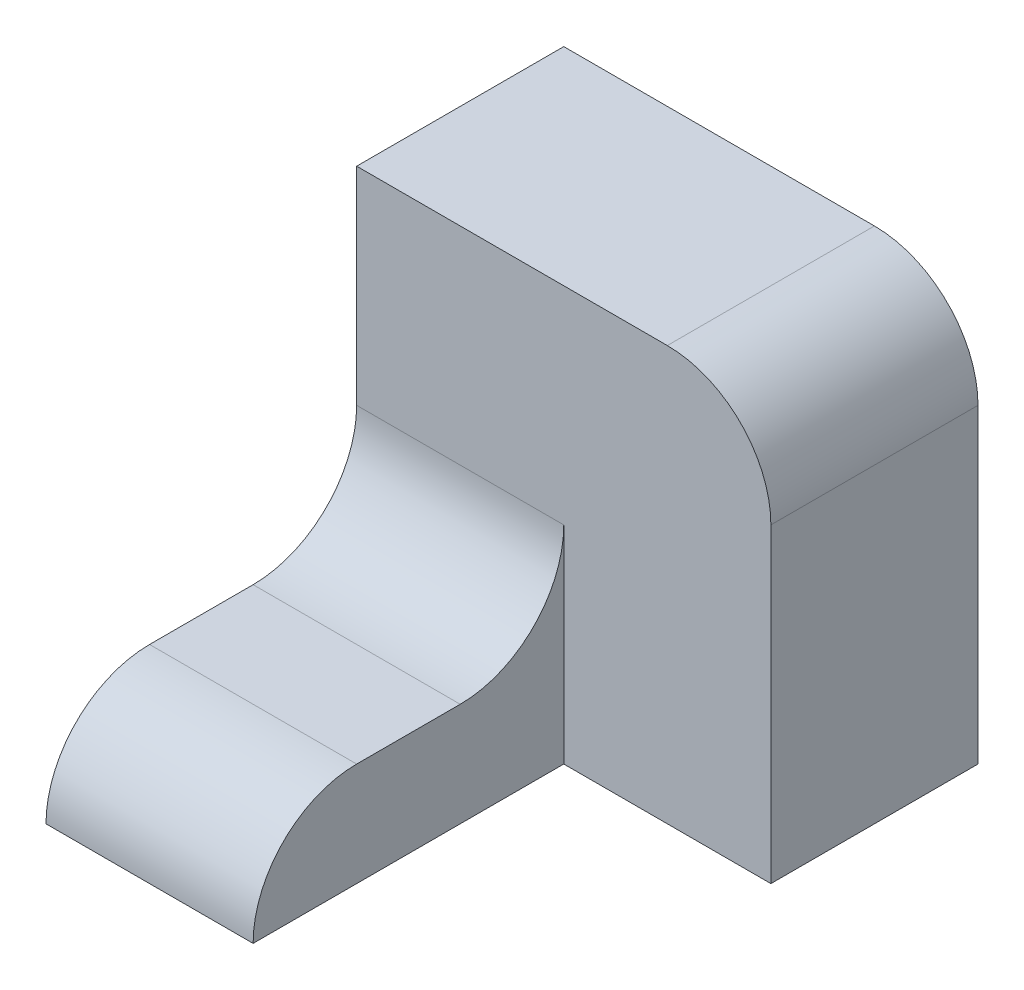
ISO-10303-21;
HEADER;
FILE_DESCRIPTION(('STEP AP214'),'2;1');
FILE_NAME('part.step','',(''),(''),'','','');
FILE_SCHEMA(('AUTOMOTIVE_DESIGN { 1 0 10303 214 1 1 1 1 }'));
ENDSEC;
DATA;
#1=APPLICATION_CONTEXT('core data for automotive mechanical design processes');
#2=APPLICATION_PROTOCOL_DEFINITION('international standard','automotive_design',2000,#1);
#3=PRODUCT_CONTEXT('',#1,'mechanical');
#4=PRODUCT('Part','Part','',(#3));
#5=PRODUCT_RELATED_PRODUCT_CATEGORY('part','',(#4));
#6=PRODUCT_DEFINITION_FORMATION('','',#4);
#7=PRODUCT_DEFINITION_CONTEXT('part definition',#1,'design');
#8=PRODUCT_DEFINITION('design','',#6,#7);
#9=PRODUCT_DEFINITION_SHAPE('','',#8);
#10=(LENGTH_UNIT() NAMED_UNIT(*) SI_UNIT(.MILLI.,.METRE.));
#11=(NAMED_UNIT(*) PLANE_ANGLE_UNIT() SI_UNIT($,.RADIAN.));
#12=(NAMED_UNIT(*) SI_UNIT($,.STERADIAN.) SOLID_ANGLE_UNIT());
#13=UNCERTAINTY_MEASURE_WITH_UNIT(LENGTH_MEASURE(1.E-05),#10,'distance_accuracy_value','');
#14=(GEOMETRIC_REPRESENTATION_CONTEXT(3) GLOBAL_UNCERTAINTY_ASSIGNED_CONTEXT((#13)) GLOBAL_UNIT_ASSIGNED_CONTEXT((#10,
#11,#12)) REPRESENTATION_CONTEXT('',''));
#15=CARTESIAN_POINT('',(0.,0.,0.));
#16=DIRECTION('',(0.,0.,1.));
#17=DIRECTION('',(1.,0.,0.));
#18=AXIS2_PLACEMENT_3D('',#15,#16,#17);
#19=CARTESIAN_POINT('',(-10.,0.,30.));
#20=DIRECTION('',(0.,-1.,0.));
#21=DIRECTION('',(1.,0.,0.));
#22=AXIS2_PLACEMENT_3D('',#19,#20,#21);
#23=PLANE('',#22);
#24=DIRECTION('',(0.,0.,-1.));
#25=VECTOR('',#24,1.);
#26=CARTESIAN_POINT('',(-10.,0.,30.));
#27=LINE('',#26,#25);
#28=CARTESIAN_POINT('',(-10.,0.,20.));
#29=VERTEX_POINT('',#28);
#30=CARTESIAN_POINT('',(-10.,0.,10.));
#31=VERTEX_POINT('',#30);
#32=EDGE_CURVE('E144',#29,#31,#27,.T.);
#33=ORIENTED_EDGE('',*,*,#32,.T.);
#34=DIRECTION('',(-1.,0.,0.));
#35=VECTOR('',#34,1.);
#36=CARTESIAN_POINT('',(-10.,0.,10.));
#37=LINE('',#36,#35);
#38=CARTESIAN_POINT('',(-30.,0.,10.));
#39=VERTEX_POINT('',#38);
#40=EDGE_CURVE('E158',#31,#39,#37,.T.);
#41=ORIENTED_EDGE('',*,*,#40,.T.);
#42=DIRECTION('',(0.,0.,-1.));
#43=VECTOR('',#42,1.);
#44=CARTESIAN_POINT('',(-30.,0.,30.));
#45=LINE('',#44,#43);
#46=CARTESIAN_POINT('',(-30.,0.,20.));
#47=VERTEX_POINT('',#46);
#48=EDGE_CURVE('E153',#47,#39,#45,.T.);
#49=ORIENTED_EDGE('',*,*,#48,.F.);
#50=DIRECTION('',(-1.,0.,0.));
#51=VECTOR('',#50,1.);
#52=CARTESIAN_POINT('',(-10.,0.,20.));
#53=LINE('',#52,#51);
#54=EDGE_CURVE('E156',#47,#29,#53,.F.);
#55=ORIENTED_EDGE('',*,*,#54,.T.);
#56=EDGE_LOOP('',(#33,#41,#49,#55));
#57=FACE_BOUND('',#56,.T.);
#58=ADVANCED_FACE('F35',(#57),#23,.F.);
#59=CARTESIAN_POINT('',(-30.,0.,30.));
#60=DIRECTION('',(1.,0.,0.));
#61=DIRECTION('',(0.,0.,-1.));
#62=AXIS2_PLACEMENT_3D('',#59,#60,#61);
#63=PLANE('',#62);
#64=DIRECTION('',(0.,0.,-1.));
#65=VECTOR('',#64,1.);
#66=CARTESIAN_POINT('',(-30.,-10.,30.));
#67=LINE('',#66,#65);
#68=CARTESIAN_POINT('',(-30.,-10.,30.));
#69=VERTEX_POINT('',#68);
#70=CARTESIAN_POINT('',(-30.,-10.,-20.));
#71=VERTEX_POINT('',#70);
#72=EDGE_CURVE('E151',#69,#71,#67,.T.);
#73=ORIENTED_EDGE('',*,*,#72,.F.);
#74=CARTESIAN_POINT('',(-30.,-10.,20.));
#75=DIRECTION('',(1.,0.,0.));
#76=DIRECTION('',(0.,0.,-1.));
#77=AXIS2_PLACEMENT_3D('',#74,#75,#76);
#78=CIRCLE('',#77,10.);
#79=EDGE_CURVE('E171',#69,#47,#78,.F.);
#80=ORIENTED_EDGE('',*,*,#79,.T.);
#81=ORIENTED_EDGE('',*,*,#48,.T.);
#82=CARTESIAN_POINT('',(-30.,10.,10.));
#83=DIRECTION('',(1.,0.,0.));
#84=DIRECTION('',(0.,0.,-1.));
#85=AXIS2_PLACEMENT_3D('',#82,#83,#84);
#86=CIRCLE('',#85,10.);
#87=CARTESIAN_POINT('',(-30.,10.,0.));
#88=VERTEX_POINT('',#87);
#89=EDGE_CURVE('E43',#39,#88,#86,.T.);
#90=ORIENTED_EDGE('',*,*,#89,.T.);
#91=DIRECTION('',(0.,-1.,0.));
#92=VECTOR('',#91,1.);
#93=CARTESIAN_POINT('',(-30.,30.,0.));
#94=LINE('',#93,#92);
#95=CARTESIAN_POINT('',(-30.,30.,0.));
#96=VERTEX_POINT('',#95);
#97=EDGE_CURVE('E119',#96,#88,#94,.T.);
#98=ORIENTED_EDGE('',*,*,#97,.F.);
#99=DIRECTION('',(0.,0.,1.));
#100=VECTOR('',#99,1.);
#101=CARTESIAN_POINT('',(-30.,30.,-20.));
#102=LINE('',#101,#100);
#103=CARTESIAN_POINT('',(-30.,30.,-20.));
#104=VERTEX_POINT('',#103);
#105=EDGE_CURVE('E108',#104,#96,#102,.T.);
#106=ORIENTED_EDGE('',*,*,#105,.F.);
#107=DIRECTION('',(0.,-1.,0.));
#108=VECTOR('',#107,1.);
#109=CARTESIAN_POINT('',(-30.,30.,-20.));
#110=LINE('',#109,#108);
#111=EDGE_CURVE('E111',#104,#71,#110,.T.);
#112=ORIENTED_EDGE('',*,*,#111,.T.);
#113=EDGE_LOOP('',(#73,#80,#81,#90,#98,#106,#112));
#114=FACE_BOUND('',#113,.T.);
#115=ADVANCED_FACE('F117',(#114),#63,.F.);
#116=CARTESIAN_POINT('',(-30.,-10.,30.));
#117=DIRECTION('',(0.,1.,0.));
#118=DIRECTION('',(0.,0.,1.));
#119=AXIS2_PLACEMENT_3D('',#116,#117,#118);
#120=PLANE('',#119);
#121=ORIENTED_EDGE('',*,*,#72,.T.);
#122=DIRECTION('',(1.,0.,0.));
#123=VECTOR('',#122,1.);
#124=CARTESIAN_POINT('',(-30.,-10.,-20.));
#125=LINE('',#124,#123);
#126=CARTESIAN_POINT('',(10.,-10.,-20.));
#127=VERTEX_POINT('',#126);
#128=EDGE_CURVE('E126',#71,#127,#125,.T.);
#129=ORIENTED_EDGE('',*,*,#128,.T.);
#130=DIRECTION('',(0.,0.,1.));
#131=VECTOR('',#130,1.);
#132=CARTESIAN_POINT('',(10.,-10.,-20.));
#133=LINE('',#132,#131);
#134=CARTESIAN_POINT('',(10.,-10.,0.));
#135=VERTEX_POINT('',#134);
#136=EDGE_CURVE('E120',#127,#135,#133,.T.);
#137=ORIENTED_EDGE('',*,*,#136,.T.);
#138=DIRECTION('',(1.,0.,0.));
#139=VECTOR('',#138,1.);
#140=CARTESIAN_POINT('',(-30.,-10.,0.));
#141=LINE('',#140,#139);
#142=CARTESIAN_POINT('',(-10.,-10.,0.));
#143=VERTEX_POINT('',#142);
#144=EDGE_CURVE('E134',#143,#135,#141,.T.);
#145=ORIENTED_EDGE('',*,*,#144,.F.);
#146=DIRECTION('',(0.,0.,-1.));
#147=VECTOR('',#146,1.);
#148=CARTESIAN_POINT('',(-10.,-10.,30.));
#149=LINE('',#148,#147);
#150=CARTESIAN_POINT('',(-10.,-10.,30.));
#151=VERTEX_POINT('',#150);
#152=EDGE_CURVE('E148',#151,#143,#149,.T.);
#153=ORIENTED_EDGE('',*,*,#152,.F.);
#154=DIRECTION('',(1.,0.,0.));
#155=VECTOR('',#154,1.);
#156=CARTESIAN_POINT('',(-30.,-10.,30.));
#157=LINE('',#156,#155);
#158=EDGE_CURVE('E141',#69,#151,#157,.T.);
#159=ORIENTED_EDGE('',*,*,#158,.F.);
#160=EDGE_LOOP('',(#121,#129,#137,#145,#153,#159));
#161=FACE_BOUND('',#160,.T.);
#162=ADVANCED_FACE('F193',(#161),#120,.F.);
#163=CARTESIAN_POINT('',(-10.,-10.,30.));
#164=DIRECTION('',(-1.,0.,0.));
#165=DIRECTION('',(0.,0.,1.));
#166=AXIS2_PLACEMENT_3D('',#163,#164,#165);
#167=PLANE('',#166);
#168=ORIENTED_EDGE('',*,*,#32,.F.);
#169=CARTESIAN_POINT('',(-10.,-10.,20.));
#170=DIRECTION('',(-1.,0.,0.));
#171=DIRECTION('',(0.,0.,1.));
#172=AXIS2_PLACEMENT_3D('',#169,#170,#171);
#173=CIRCLE('',#172,10.);
#174=EDGE_CURVE('E173',#29,#151,#173,.F.);
#175=ORIENTED_EDGE('',*,*,#174,.T.);
#176=ORIENTED_EDGE('',*,*,#152,.T.);
#177=DIRECTION('',(0.,1.,0.));
#178=VECTOR('',#177,1.);
#179=CARTESIAN_POINT('',(-10.,-10.,0.));
#180=LINE('',#179,#178);
#181=CARTESIAN_POINT('',(-10.,10.,0.));
#182=VERTEX_POINT('',#181);
#183=EDGE_CURVE('E139',#143,#182,#180,.T.);
#184=ORIENTED_EDGE('',*,*,#183,.T.);
#185=CARTESIAN_POINT('',(-10.,10.,10.));
#186=DIRECTION('',(-1.,0.,0.));
#187=DIRECTION('',(0.,0.,1.));
#188=AXIS2_PLACEMENT_3D('',#185,#186,#187);
#189=CIRCLE('',#188,10.);
#190=EDGE_CURVE('E11',#182,#31,#189,.T.);
#191=ORIENTED_EDGE('',*,*,#190,.T.);
#192=EDGE_LOOP('',(#168,#175,#176,#184,#191));
#193=FACE_BOUND('',#192,.T.);
#194=ADVANCED_FACE('F184',(#193),#167,.F.);
#195=CARTESIAN_POINT('',(0.,0.,0.));
#196=DIRECTION('',(0.,0.,1.));
#197=DIRECTION('',(1.,0.,0.));
#198=AXIS2_PLACEMENT_3D('',#195,#196,#197);
#199=PLANE('',#198);
#200=ORIENTED_EDGE('',*,*,#97,.T.);
#201=DIRECTION('',(-1.,0.,0.));
#202=VECTOR('',#201,1.);
#203=CARTESIAN_POINT('',(0.,10.,0.));
#204=LINE('',#203,#202);
#205=EDGE_CURVE('E163',#88,#182,#204,.F.);
#206=ORIENTED_EDGE('',*,*,#205,.T.);
#207=ORIENTED_EDGE('',*,*,#183,.F.);
#208=ORIENTED_EDGE('',*,*,#144,.T.);
#209=DIRECTION('',(0.,1.,0.));
#210=VECTOR('',#209,1.);
#211=CARTESIAN_POINT('',(10.,-10.,0.));
#212=LINE('',#211,#210);
#213=CARTESIAN_POINT('',(10.,20.,0.));
#214=VERTEX_POINT('',#213);
#215=EDGE_CURVE('E112',#135,#214,#212,.T.);
#216=ORIENTED_EDGE('',*,*,#215,.T.);
#217=CARTESIAN_POINT('',(0.,20.,0.));
#218=DIRECTION('',(0.,0.,1.));
#219=DIRECTION('',(1.,0.,0.));
#220=AXIS2_PLACEMENT_3D('',#217,#218,#219);
#221=CIRCLE('',#220,10.);
#222=CARTESIAN_POINT('',(0.,30.,0.));
#223=VERTEX_POINT('',#222);
#224=EDGE_CURVE('E161',#214,#223,#221,.T.);
#225=ORIENTED_EDGE('',*,*,#224,.T.);
#226=DIRECTION('',(-1.,0.,0.));
#227=VECTOR('',#226,1.);
#228=CARTESIAN_POINT('',(10.,30.,0.));
#229=LINE('',#228,#227);
#230=EDGE_CURVE('E131',#223,#96,#229,.T.);
#231=ORIENTED_EDGE('',*,*,#230,.T.);
#232=EDGE_LOOP('',(#200,#206,#207,#208,#216,#225,#231));
#233=FACE_BOUND('',#232,.T.);
#234=ADVANCED_FACE('F179',(#233),#199,.T.);
#235=CARTESIAN_POINT('',(10.,30.,-20.));
#236=DIRECTION('',(0.,1.,0.));
#237=DIRECTION('',(-1.,0.,0.));
#238=AXIS2_PLACEMENT_3D('',#235,#236,#237);
#239=PLANE('',#238);
#240=ORIENTED_EDGE('',*,*,#230,.F.);
#241=DIRECTION('',(0.,0.,1.));
#242=VECTOR('',#241,1.);
#243=CARTESIAN_POINT('',(0.,30.,-20.));
#244=LINE('',#243,#242);
#245=CARTESIAN_POINT('',(0.,30.,-20.));
#246=VERTEX_POINT('',#245);
#247=EDGE_CURVE('E50',#223,#246,#244,.F.);
#248=ORIENTED_EDGE('',*,*,#247,.T.);
#249=DIRECTION('',(-1.,0.,0.));
#250=VECTOR('',#249,1.);
#251=CARTESIAN_POINT('',(10.,30.,-20.));
#252=LINE('',#251,#250);
#253=EDGE_CURVE('E105',#246,#104,#252,.T.);
#254=ORIENTED_EDGE('',*,*,#253,.T.);
#255=ORIENTED_EDGE('',*,*,#105,.T.);
#256=EDGE_LOOP('',(#240,#248,#254,#255));
#257=FACE_BOUND('',#256,.T.);
#258=ADVANCED_FACE('F107',(#257),#239,.T.);
#259=CARTESIAN_POINT('',(10.,-10.,-20.));
#260=DIRECTION('',(1.,0.,0.));
#261=DIRECTION('',(0.,0.,-1.));
#262=AXIS2_PLACEMENT_3D('',#259,#260,#261);
#263=PLANE('',#262);
#264=DIRECTION('',(0.,1.,0.));
#265=VECTOR('',#264,1.);
#266=CARTESIAN_POINT('',(10.,-10.,-20.));
#267=LINE('',#266,#265);
#268=CARTESIAN_POINT('',(10.,20.,-20.));
#269=VERTEX_POINT('',#268);
#270=EDGE_CURVE('E121',#127,#269,#267,.T.);
#271=ORIENTED_EDGE('',*,*,#270,.T.);
#272=DIRECTION('',(0.,0.,1.));
#273=VECTOR('',#272,1.);
#274=CARTESIAN_POINT('',(10.,20.,-20.));
#275=LINE('',#274,#273);
#276=EDGE_CURVE('E166',#269,#214,#275,.T.);
#277=ORIENTED_EDGE('',*,*,#276,.T.);
#278=ORIENTED_EDGE('',*,*,#215,.F.);
#279=ORIENTED_EDGE('',*,*,#136,.F.);
#280=EDGE_LOOP('',(#271,#277,#278,#279));
#281=FACE_BOUND('',#280,.T.);
#282=ADVANCED_FACE('F196',(#281),#263,.T.);
#283=CARTESIAN_POINT('',(0.,0.,-20.));
#284=DIRECTION('',(0.,0.,1.));
#285=DIRECTION('',(1.,0.,0.));
#286=AXIS2_PLACEMENT_3D('',#283,#284,#285);
#287=PLANE('',#286);
#288=ORIENTED_EDGE('',*,*,#253,.F.);
#289=CARTESIAN_POINT('',(0.,20.,-20.));
#290=DIRECTION('',(0.,0.,1.));
#291=DIRECTION('',(1.,0.,0.));
#292=AXIS2_PLACEMENT_3D('',#289,#290,#291);
#293=CIRCLE('',#292,10.);
#294=EDGE_CURVE('E57',#246,#269,#293,.F.);
#295=ORIENTED_EDGE('',*,*,#294,.T.);
#296=ORIENTED_EDGE('',*,*,#270,.F.);
#297=ORIENTED_EDGE('',*,*,#128,.F.);
#298=ORIENTED_EDGE('',*,*,#111,.F.);
#299=EDGE_LOOP('',(#288,#295,#296,#297,#298));
#300=FACE_BOUND('',#299,.T.);
#301=ADVANCED_FACE('F124',(#300),#287,.F.);
#302=CARTESIAN_POINT('',(-10.,10.,10.));
#303=DIRECTION('',(-1.,0.,0.));
#304=DIRECTION('',(0.,-1.,0.));
#305=AXIS2_PLACEMENT_3D('',#302,#303,#304);
#306=CYLINDRICAL_SURFACE('',#305,10.);
#307=ORIENTED_EDGE('',*,*,#190,.F.);
#308=ORIENTED_EDGE('',*,*,#205,.F.);
#309=ORIENTED_EDGE('',*,*,#89,.F.);
#310=ORIENTED_EDGE('',*,*,#40,.F.);
#311=EDGE_LOOP('',(#307,#308,#309,#310));
#312=FACE_BOUND('',#311,.T.);
#313=ADVANCED_FACE('F181',(#312),#306,.F.);
#314=CARTESIAN_POINT('',(0.,20.,-20.));
#315=DIRECTION('',(0.,0.,1.));
#316=DIRECTION('',(1.,0.,0.));
#317=AXIS2_PLACEMENT_3D('',#314,#315,#316);
#318=CYLINDRICAL_SURFACE('',#317,10.);
#319=ORIENTED_EDGE('',*,*,#294,.F.);
#320=ORIENTED_EDGE('',*,*,#247,.F.);
#321=ORIENTED_EDGE('',*,*,#224,.F.);
#322=ORIENTED_EDGE('',*,*,#276,.F.);
#323=EDGE_LOOP('',(#319,#320,#321,#322));
#324=FACE_BOUND('',#323,.T.);
#325=ADVANCED_FACE('F199',(#324),#318,.T.);
#326=CARTESIAN_POINT('',(0.,-10.,20.));
#327=DIRECTION('',(1.,0.,0.));
#328=DIRECTION('',(0.,1.,0.));
#329=AXIS2_PLACEMENT_3D('',#326,#327,#328);
#330=CYLINDRICAL_SURFACE('',#329,10.);
#331=ORIENTED_EDGE('',*,*,#174,.F.);
#332=ORIENTED_EDGE('',*,*,#54,.F.);
#333=ORIENTED_EDGE('',*,*,#79,.F.);
#334=ORIENTED_EDGE('',*,*,#158,.T.);
#335=EDGE_LOOP('',(#331,#332,#333,#334));
#336=FACE_BOUND('',#335,.T.);
#337=ADVANCED_FACE('F37',(#336),#330,.T.);
#338=CLOSED_SHELL('',(#58,#115,#162,#194,#234,#258,#282,#301,#313,#325,#337));
#339=MANIFOLD_SOLID_BREP('B2',#338);
#340=ADVANCED_BREP_SHAPE_REPRESENTATION('',(#18,#339),#14);
#341=SHAPE_DEFINITION_REPRESENTATION(#9,#340);
ENDSEC;
END-ISO-10303-21;
